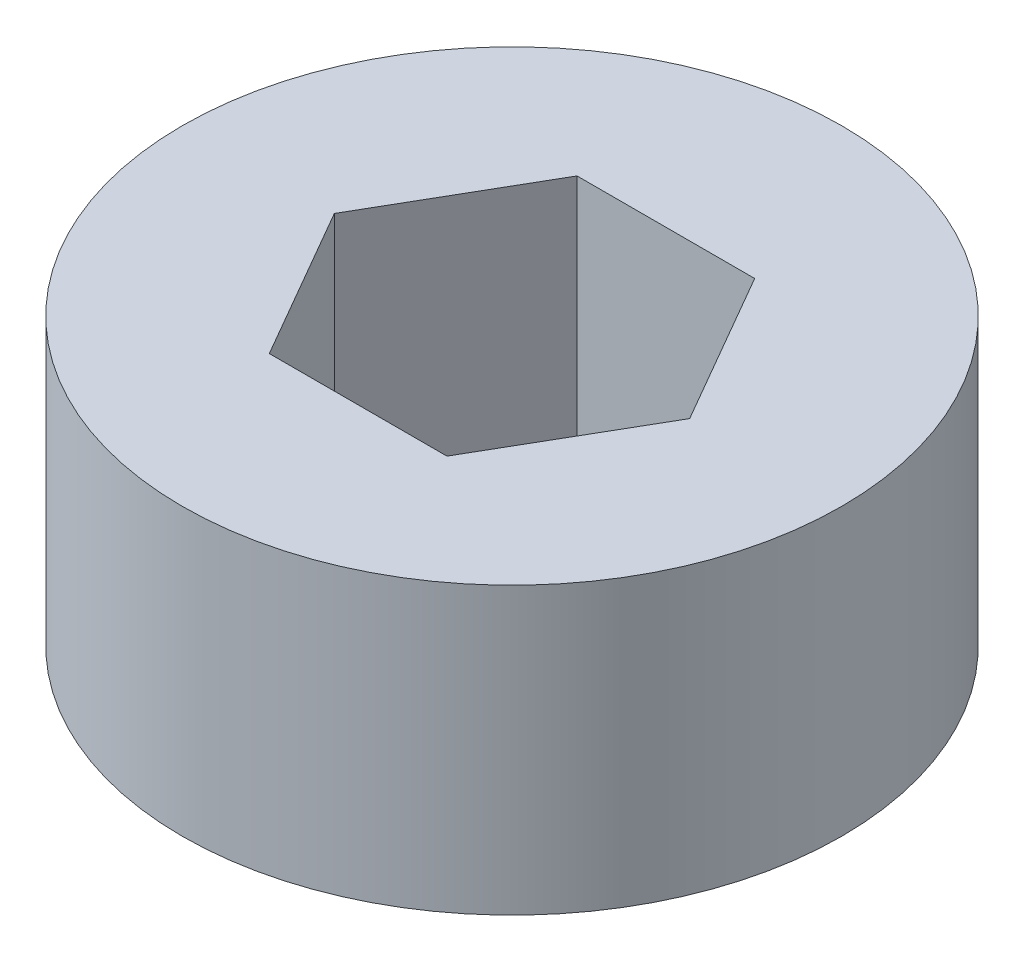
ISO-10303-21;
HEADER;
FILE_DESCRIPTION(('STEP AP214'),'2;1');
FILE_NAME('part.step','',(''),(''),'','','');
FILE_SCHEMA(('AUTOMOTIVE_DESIGN { 1 0 10303 214 1 1 1 1 }'));
ENDSEC;
DATA;
#1=APPLICATION_CONTEXT('core data for automotive mechanical design processes');
#2=APPLICATION_PROTOCOL_DEFINITION('international standard','automotive_design',2000,#1);
#3=PRODUCT_CONTEXT('',#1,'mechanical');
#4=PRODUCT('Part','Part','',(#3));
#5=PRODUCT_RELATED_PRODUCT_CATEGORY('part','',(#4));
#6=PRODUCT_DEFINITION_FORMATION('','',#4);
#7=PRODUCT_DEFINITION_CONTEXT('part definition',#1,'design');
#8=PRODUCT_DEFINITION('design','',#6,#7);
#9=PRODUCT_DEFINITION_SHAPE('','',#8);
#10=(LENGTH_UNIT() NAMED_UNIT(*) SI_UNIT(.MILLI.,.METRE.));
#11=(NAMED_UNIT(*) PLANE_ANGLE_UNIT() SI_UNIT($,.RADIAN.));
#12=(NAMED_UNIT(*) SI_UNIT($,.STERADIAN.) SOLID_ANGLE_UNIT());
#13=UNCERTAINTY_MEASURE_WITH_UNIT(LENGTH_MEASURE(1.E-05),#10,'distance_accuracy_value','');
#14=(GEOMETRIC_REPRESENTATION_CONTEXT(3) GLOBAL_UNCERTAINTY_ASSIGNED_CONTEXT((#13)) GLOBAL_UNIT_ASSIGNED_CONTEXT((#10,
#11,#12)) REPRESENTATION_CONTEXT('',''));
#15=CARTESIAN_POINT('',(0.,0.,0.));
#16=DIRECTION('',(0.,0.,1.));
#17=DIRECTION('',(1.,0.,0.));
#18=AXIS2_PLACEMENT_3D('',#15,#16,#17);
#19=CARTESIAN_POINT('',(0.,13.,0.));
#20=DIRECTION('',(0.,1.,0.));
#21=DIRECTION('',(0.,0.,1.));
#22=AXIS2_PLACEMENT_3D('',#19,#20,#21);
#23=PLANE('',#22);
#24=CARTESIAN_POINT('',(0.,13.,0.));
#25=DIRECTION('',(0.,1.,0.));
#26=DIRECTION('',(0.,0.,1.));
#27=AXIS2_PLACEMENT_3D('',#24,#25,#26);
#28=CIRCLE('',#27,15.);
#29=CARTESIAN_POINT('',(0.,13.,15.));
#30=VERTEX_POINT('',#29);
#31=EDGE_CURVE('E94',#30,#30,#28,.T.);
#32=ORIENTED_EDGE('',*,*,#31,.T.);
#33=EDGE_LOOP('',(#32));
#34=FACE_BOUND('',#33,.T.);
#35=DIRECTION('',(0.5,0.,0.866025403784439));
#36=VECTOR('',#35,1.);
#37=CARTESIAN_POINT('',(6.06217782649107,13.,-3.5));
#38=LINE('',#37,#36);
#39=CARTESIAN_POINT('',(4.04145188432738,13.,-7.));
#40=VERTEX_POINT('',#39);
#41=CARTESIAN_POINT('',(8.08290376865476,13.,0.));
#42=VERTEX_POINT('',#41);
#43=EDGE_CURVE('E142',#40,#42,#38,.T.);
#44=ORIENTED_EDGE('',*,*,#43,.T.);
#45=DIRECTION('',(-0.5,0.,0.866025403784439));
#46=VECTOR('',#45,1.);
#47=CARTESIAN_POINT('',(6.06217782649107,13.,3.5));
#48=LINE('',#47,#46);
#49=CARTESIAN_POINT('',(4.04145188432738,13.,7.));
#50=VERTEX_POINT('',#49);
#51=EDGE_CURVE('E127',#42,#50,#48,.T.);
#52=ORIENTED_EDGE('',*,*,#51,.T.);
#53=DIRECTION('',(-1.,0.,0.));
#54=VECTOR('',#53,1.);
#55=CARTESIAN_POINT('',(0.,13.,7.));
#56=LINE('',#55,#54);
#57=CARTESIAN_POINT('',(-4.04145188432738,13.,7.));
#58=VERTEX_POINT('',#57);
#59=EDGE_CURVE('E128',#50,#58,#56,.T.);
#60=ORIENTED_EDGE('',*,*,#59,.T.);
#61=DIRECTION('',(-0.5,0.,-0.866025403784439));
#62=VECTOR('',#61,1.);
#63=CARTESIAN_POINT('',(-6.06217782649108,13.,3.5));
#64=LINE('',#63,#62);
#65=CARTESIAN_POINT('',(-8.08290376865477,13.,0.));
#66=VERTEX_POINT('',#65);
#67=EDGE_CURVE('E101',#58,#66,#64,.T.);
#68=ORIENTED_EDGE('',*,*,#67,.T.);
#69=DIRECTION('',(0.5,0.,-0.866025403784439));
#70=VECTOR('',#69,1.);
#71=CARTESIAN_POINT('',(-6.06217782649107,13.,-3.5));
#72=LINE('',#71,#70);
#73=CARTESIAN_POINT('',(-4.04145188432738,13.,-7.));
#74=VERTEX_POINT('',#73);
#75=EDGE_CURVE('E136',#66,#74,#72,.T.);
#76=ORIENTED_EDGE('',*,*,#75,.T.);
#77=DIRECTION('',(1.,0.,0.));
#78=VECTOR('',#77,1.);
#79=CARTESIAN_POINT('',(0.,13.,-7.));
#80=LINE('',#79,#78);
#81=EDGE_CURVE('E139',#74,#40,#80,.T.);
#82=ORIENTED_EDGE('',*,*,#81,.T.);
#83=EDGE_LOOP('',(#44,#52,#60,#68,#76,#82));
#84=FACE_BOUND('',#83,.T.);
#85=ADVANCED_FACE('F39',(#34,#84),#23,.T.);
#86=CARTESIAN_POINT('',(0.,0.,0.));
#87=DIRECTION('',(0.,1.,0.));
#88=DIRECTION('',(0.,0.,1.));
#89=AXIS2_PLACEMENT_3D('',#86,#87,#88);
#90=PLANE('',#89);
#91=CARTESIAN_POINT('',(0.,0.,0.));
#92=DIRECTION('',(0.,1.,0.));
#93=DIRECTION('',(0.,0.,1.));
#94=AXIS2_PLACEMENT_3D('',#91,#92,#93);
#95=CIRCLE('',#94,15.);
#96=CARTESIAN_POINT('',(0.,0.,15.));
#97=VERTEX_POINT('',#96);
#98=EDGE_CURVE('E145',#97,#97,#95,.T.);
#99=ORIENTED_EDGE('',*,*,#98,.F.);
#100=EDGE_LOOP('',(#99));
#101=FACE_BOUND('',#100,.T.);
#102=DIRECTION('',(-0.5,0.,0.866025403784439));
#103=VECTOR('',#102,1.);
#104=CARTESIAN_POINT('',(6.06217782649107,0.,3.5));
#105=LINE('',#104,#103);
#106=CARTESIAN_POINT('',(8.08290376865476,0.,0.));
#107=VERTEX_POINT('',#106);
#108=CARTESIAN_POINT('',(4.04145188432738,0.,7.));
#109=VERTEX_POINT('',#108);
#110=EDGE_CURVE('E11',#107,#109,#105,.T.);
#111=ORIENTED_EDGE('',*,*,#110,.F.);
#112=DIRECTION('',(0.5,0.,0.866025403784439));
#113=VECTOR('',#112,1.);
#114=CARTESIAN_POINT('',(6.06217782649107,0.,-3.5));
#115=LINE('',#114,#113);
#116=CARTESIAN_POINT('',(4.04145188432738,0.,-7.));
#117=VERTEX_POINT('',#116);
#118=EDGE_CURVE('E47',#117,#107,#115,.T.);
#119=ORIENTED_EDGE('',*,*,#118,.F.);
#120=DIRECTION('',(1.,0.,0.));
#121=VECTOR('',#120,1.);
#122=CARTESIAN_POINT('',(0.,0.,-7.));
#123=LINE('',#122,#121);
#124=CARTESIAN_POINT('',(-4.04145188432738,0.,-7.));
#125=VERTEX_POINT('',#124);
#126=EDGE_CURVE('E110',#125,#117,#123,.T.);
#127=ORIENTED_EDGE('',*,*,#126,.F.);
#128=DIRECTION('',(0.5,0.,-0.866025403784439));
#129=VECTOR('',#128,1.);
#130=CARTESIAN_POINT('',(-6.06217782649107,0.,-3.5));
#131=LINE('',#130,#129);
#132=CARTESIAN_POINT('',(-8.08290376865477,0.,0.));
#133=VERTEX_POINT('',#132);
#134=EDGE_CURVE('E108',#133,#125,#131,.T.);
#135=ORIENTED_EDGE('',*,*,#134,.F.);
#136=DIRECTION('',(-0.5,0.,-0.866025403784439));
#137=VECTOR('',#136,1.);
#138=CARTESIAN_POINT('',(-6.06217782649108,0.,3.5));
#139=LINE('',#138,#137);
#140=CARTESIAN_POINT('',(-4.04145188432738,0.,7.));
#141=VERTEX_POINT('',#140);
#142=EDGE_CURVE('E93',#141,#133,#139,.T.);
#143=ORIENTED_EDGE('',*,*,#142,.F.);
#144=DIRECTION('',(-1.,0.,0.));
#145=VECTOR('',#144,1.);
#146=CARTESIAN_POINT('',(0.,0.,7.));
#147=LINE('',#146,#145);
#148=EDGE_CURVE('E88',#109,#141,#147,.T.);
#149=ORIENTED_EDGE('',*,*,#148,.F.);
#150=EDGE_LOOP('',(#111,#119,#127,#135,#143,#149));
#151=FACE_BOUND('',#150,.T.);
#152=ADVANCED_FACE('F106',(#101,#151),#90,.F.);
#153=CARTESIAN_POINT('',(0.,13.,0.));
#154=DIRECTION('',(0.,-1.,0.));
#155=DIRECTION('',(0.,0.,-1.));
#156=AXIS2_PLACEMENT_3D('',#153,#154,#155);
#157=CYLINDRICAL_SURFACE('',#156,15.);
#158=ORIENTED_EDGE('',*,*,#31,.F.);
#159=EDGE_LOOP('',(#158));
#160=FACE_BOUND('',#159,.T.);
#161=ORIENTED_EDGE('',*,*,#98,.T.);
#162=EDGE_LOOP('',(#161));
#163=FACE_BOUND('',#162,.T.);
#164=ADVANCED_FACE('F41',(#160,#163),#157,.T.);
#165=CARTESIAN_POINT('',(4.04145188432738,39.,7.));
#166=DIRECTION('',(-0.866025403784439,0.,-0.5));
#167=DIRECTION('',(-0.5,0.,0.866025403784439));
#168=AXIS2_PLACEMENT_3D('',#165,#166,#167);
#169=PLANE('',#168);
#170=DIRECTION('',(0.,-1.,0.));
#171=VECTOR('',#170,1.);
#172=CARTESIAN_POINT('',(8.08290376865476,39.,0.));
#173=LINE('',#172,#171);
#174=EDGE_CURVE('E120',#42,#107,#173,.T.);
#175=ORIENTED_EDGE('',*,*,#174,.T.);
#176=ORIENTED_EDGE('',*,*,#110,.T.);
#177=DIRECTION('',(0.,-1.,0.));
#178=VECTOR('',#177,1.);
#179=CARTESIAN_POINT('',(4.04145188432738,39.,7.));
#180=LINE('',#179,#178);
#181=EDGE_CURVE('E59',#50,#109,#180,.T.);
#182=ORIENTED_EDGE('',*,*,#181,.F.);
#183=ORIENTED_EDGE('',*,*,#51,.F.);
#184=EDGE_LOOP('',(#175,#176,#182,#183));
#185=FACE_BOUND('',#184,.T.);
#186=ADVANCED_FACE('F125',(#185),#169,.T.);
#187=CARTESIAN_POINT('',(8.08290376865476,39.,0.));
#188=DIRECTION('',(-0.866025403784439,0.,0.5));
#189=DIRECTION('',(0.5,0.,0.866025403784439));
#190=AXIS2_PLACEMENT_3D('',#187,#188,#189);
#191=PLANE('',#190);
#192=DIRECTION('',(0.,-1.,0.));
#193=VECTOR('',#192,1.);
#194=CARTESIAN_POINT('',(4.04145188432738,39.,-7.));
#195=LINE('',#194,#193);
#196=EDGE_CURVE('E123',#40,#117,#195,.T.);
#197=ORIENTED_EDGE('',*,*,#196,.T.);
#198=ORIENTED_EDGE('',*,*,#118,.T.);
#199=ORIENTED_EDGE('',*,*,#174,.F.);
#200=ORIENTED_EDGE('',*,*,#43,.F.);
#201=EDGE_LOOP('',(#197,#198,#199,#200));
#202=FACE_BOUND('',#201,.T.);
#203=ADVANCED_FACE('F119',(#202),#191,.T.);
#204=CARTESIAN_POINT('',(4.04145188432738,39.,-7.));
#205=DIRECTION('',(0.,0.,1.));
#206=DIRECTION('',(1.,0.,0.));
#207=AXIS2_PLACEMENT_3D('',#204,#205,#206);
#208=PLANE('',#207);
#209=DIRECTION('',(0.,-1.,0.));
#210=VECTOR('',#209,1.);
#211=CARTESIAN_POINT('',(-4.04145188432738,39.,-7.));
#212=LINE('',#211,#210);
#213=EDGE_CURVE('E131',#74,#125,#212,.T.);
#214=ORIENTED_EDGE('',*,*,#213,.T.);
#215=ORIENTED_EDGE('',*,*,#126,.T.);
#216=ORIENTED_EDGE('',*,*,#196,.F.);
#217=ORIENTED_EDGE('',*,*,#81,.F.);
#218=EDGE_LOOP('',(#214,#215,#216,#217));
#219=FACE_BOUND('',#218,.T.);
#220=ADVANCED_FACE('F164',(#219),#208,.T.);
#221=CARTESIAN_POINT('',(-4.04145188432738,39.,-7.));
#222=DIRECTION('',(0.866025403784439,0.,0.5));
#223=DIRECTION('',(0.5,0.,-0.866025403784439));
#224=AXIS2_PLACEMENT_3D('',#221,#222,#223);
#225=PLANE('',#224);
#226=DIRECTION('',(0.,-1.,0.));
#227=VECTOR('',#226,1.);
#228=CARTESIAN_POINT('',(-8.08290376865477,39.,0.));
#229=LINE('',#228,#227);
#230=EDGE_CURVE('E103',#66,#133,#229,.T.);
#231=ORIENTED_EDGE('',*,*,#230,.T.);
#232=ORIENTED_EDGE('',*,*,#134,.T.);
#233=ORIENTED_EDGE('',*,*,#213,.F.);
#234=ORIENTED_EDGE('',*,*,#75,.F.);
#235=EDGE_LOOP('',(#231,#232,#233,#234));
#236=FACE_BOUND('',#235,.T.);
#237=ADVANCED_FACE('F167',(#236),#225,.T.);
#238=CARTESIAN_POINT('',(-8.08290376865477,39.,0.));
#239=DIRECTION('',(0.866025403784439,0.,-0.5));
#240=DIRECTION('',(-0.5,0.,-0.866025403784439));
#241=AXIS2_PLACEMENT_3D('',#238,#239,#240);
#242=PLANE('',#241);
#243=DIRECTION('',(0.,-1.,0.));
#244=VECTOR('',#243,1.);
#245=CARTESIAN_POINT('',(-4.04145188432738,39.,7.));
#246=LINE('',#245,#244);
#247=EDGE_CURVE('E54',#58,#141,#246,.T.);
#248=ORIENTED_EDGE('',*,*,#247,.T.);
#249=ORIENTED_EDGE('',*,*,#142,.T.);
#250=ORIENTED_EDGE('',*,*,#230,.F.);
#251=ORIENTED_EDGE('',*,*,#67,.F.);
#252=EDGE_LOOP('',(#248,#249,#250,#251));
#253=FACE_BOUND('',#252,.T.);
#254=ADVANCED_FACE('F97',(#253),#242,.T.);
#255=CARTESIAN_POINT('',(-4.04145188432738,39.,7.));
#256=DIRECTION('',(0.,0.,-1.));
#257=DIRECTION('',(-1.,0.,0.));
#258=AXIS2_PLACEMENT_3D('',#255,#256,#257);
#259=PLANE('',#258);
#260=ORIENTED_EDGE('',*,*,#181,.T.);
#261=ORIENTED_EDGE('',*,*,#148,.T.);
#262=ORIENTED_EDGE('',*,*,#247,.F.);
#263=ORIENTED_EDGE('',*,*,#59,.F.);
#264=EDGE_LOOP('',(#260,#261,#262,#263));
#265=FACE_BOUND('',#264,.T.);
#266=ADVANCED_FACE('F89',(#265),#259,.T.);
#267=CLOSED_SHELL('',(#85,#152,#164,#186,#203,#220,#237,#254,#266));
#268=MANIFOLD_SOLID_BREP('B2',#267);
#269=ADVANCED_BREP_SHAPE_REPRESENTATION('',(#18,#268),#14);
#270=SHAPE_DEFINITION_REPRESENTATION(#9,#269);
ENDSEC;
END-ISO-10303-21;
